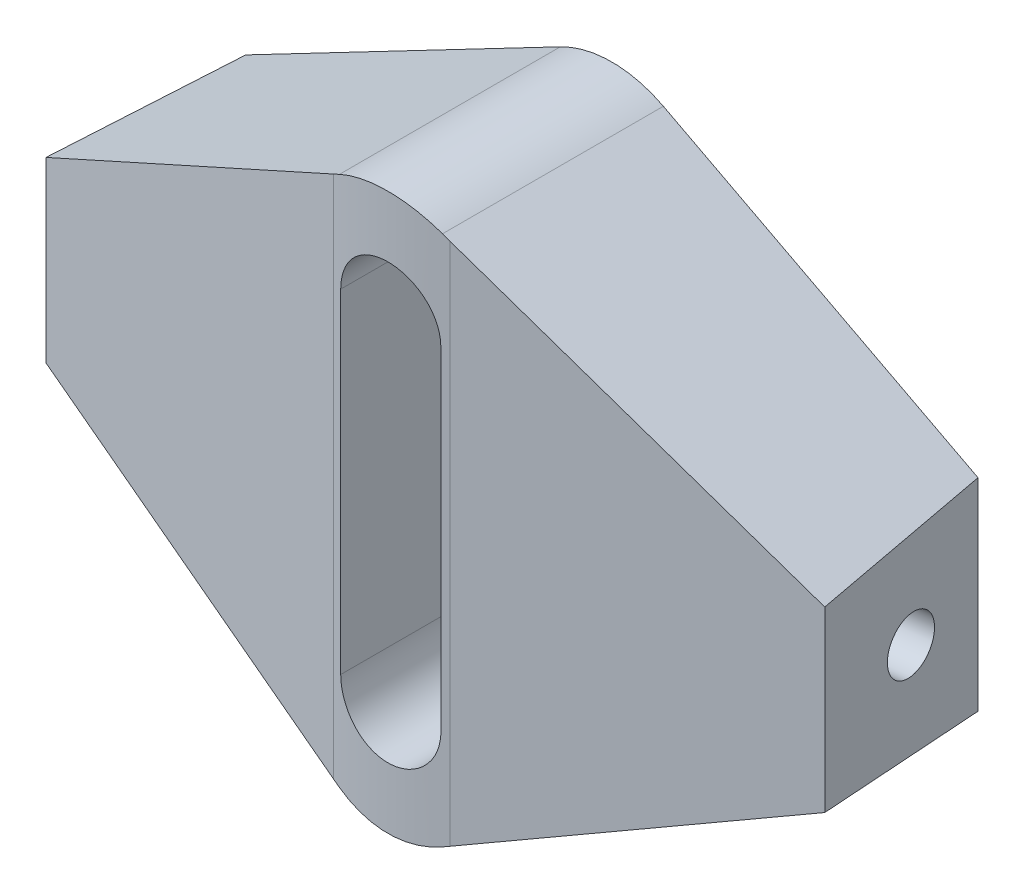
ISO-10303-21;
HEADER;
FILE_DESCRIPTION(('STEP AP214'),'2;1');
FILE_NAME('part.step','',(''),(''),'','','');
FILE_SCHEMA(('AUTOMOTIVE_DESIGN { 1 0 10303 214 1 1 1 1 }'));
ENDSEC;
DATA;
#1=APPLICATION_CONTEXT('core data for automotive mechanical design processes');
#2=APPLICATION_PROTOCOL_DEFINITION('international standard','automotive_design',2000,#1);
#3=PRODUCT_CONTEXT('',#1,'mechanical');
#4=PRODUCT('Part','Part','',(#3));
#5=PRODUCT_RELATED_PRODUCT_CATEGORY('part','',(#4));
#6=PRODUCT_DEFINITION_FORMATION('','',#4);
#7=PRODUCT_DEFINITION_CONTEXT('part definition',#1,'design');
#8=PRODUCT_DEFINITION('design','',#6,#7);
#9=PRODUCT_DEFINITION_SHAPE('','',#8);
#10=(LENGTH_UNIT() NAMED_UNIT(*) SI_UNIT(.MILLI.,.METRE.));
#11=(NAMED_UNIT(*) PLANE_ANGLE_UNIT() SI_UNIT($,.RADIAN.));
#12=(NAMED_UNIT(*) SI_UNIT($,.STERADIAN.) SOLID_ANGLE_UNIT());
#13=UNCERTAINTY_MEASURE_WITH_UNIT(LENGTH_MEASURE(1.E-05),#10,'distance_accuracy_value','');
#14=(GEOMETRIC_REPRESENTATION_CONTEXT(3) GLOBAL_UNCERTAINTY_ASSIGNED_CONTEXT((#13)) GLOBAL_UNIT_ASSIGNED_CONTEXT((#10,
#11,#12)) REPRESENTATION_CONTEXT('',''));
#15=CARTESIAN_POINT('',(0.,0.,0.));
#16=DIRECTION('',(0.,0.,1.));
#17=DIRECTION('',(1.,0.,0.));
#18=AXIS2_PLACEMENT_3D('',#15,#16,#17);
#19=CARTESIAN_POINT('',(16.4557904622396,-12.5,0.));
#20=DIRECTION('',(0.991444861373811,0.,-0.130526192220049));
#21=DIRECTION('',(-0.130526192220049,0.,-0.991444861373811));
#22=AXIS2_PLACEMENT_3D('',#19,#20,#21);
#23=PLANE('',#22);
#24=DIRECTION('',(0.,1.,0.));
#25=VECTOR('',#24,1.);
#26=CARTESIAN_POINT('',(16.4557904622396,0.,0.));
#27=LINE('',#26,#25);
#28=CARTESIAN_POINT('',(16.4557904622396,-4.54543643269465,0.));
#29=VERTEX_POINT('',#28);
#30=CARTESIAN_POINT('',(16.4557904622396,4.54543643269465,0.));
#31=VERTEX_POINT('',#30);
#32=EDGE_CURVE('E143',#29,#31,#27,.T.);
#33=ORIENTED_EDGE('',*,*,#32,.T.);
#34=DIRECTION('',(0.130223873455082,-0.0680216397384778,0.98914852237146));
#35=VECTOR('',#34,1.);
#36=CARTESIAN_POINT('',(18.7932076390999,3.32450093980472,17.754446134291));
#37=LINE('',#36,#35);
#38=CARTESIAN_POINT('',(17.5,4.,7.93155889099048));
#39=VERTEX_POINT('',#38);
#40=EDGE_CURVE('E155',#31,#39,#37,.T.);
#41=ORIENTED_EDGE('',*,*,#40,.T.);
#42=DIRECTION('',(0.,1.,0.));
#43=VECTOR('',#42,1.);
#44=CARTESIAN_POINT('',(17.5,-12.5,7.93155889099049));
#45=LINE('',#44,#43);
#46=CARTESIAN_POINT('',(17.5,-4.,7.93155889099049));
#47=VERTEX_POINT('',#46);
#48=EDGE_CURVE('E325',#47,#39,#45,.T.);
#49=ORIENTED_EDGE('',*,*,#48,.F.);
#50=DIRECTION('',(0.130223873455082,0.0680216397384778,0.98914852237146));
#51=VECTOR('',#50,1.);
#52=CARTESIAN_POINT('',(18.7932076390999,-3.32450093980472,17.754446134291));
#53=LINE('',#52,#51);
#54=EDGE_CURVE('E305',#29,#47,#53,.T.);
#55=ORIENTED_EDGE('',*,*,#54,.F.);
#56=EDGE_LOOP('',(#33,#41,#49,#55));
#57=FACE_BOUND('',#56,.T.);
#58=CARTESIAN_POINT('',(16.9126321350098,0.,3.47005701480834));
#59=DIRECTION('',(-0.991444861373811,0.,0.130526192220049));
#60=DIRECTION('',(0.130526192220049,0.,0.991444861373811));
#61=AXIS2_PLACEMENT_3D('',#58,#59,#60);
#62=CIRCLE('',#61,1.23);
#63=CARTESIAN_POINT('',(17.0731793514404,0.,4.68953419429812));
#64=VERTEX_POINT('',#63);
#65=EDGE_CURVE('E334',#64,#64,#62,.T.);
#66=ORIENTED_EDGE('',*,*,#65,.T.);
#67=EDGE_LOOP('',(#66));
#68=FACE_BOUND('',#67,.T.);
#69=ADVANCED_FACE('F35',(#57,#68),#23,.T.);
#70=CARTESIAN_POINT('',(-5.39275395509734,-10.3241455413745,20.));
#71=DIRECTION('',(0.462987271417713,0.886364928517133,0.));
#72=DIRECTION('',(-0.886364928517133,0.462987271417713,0.));
#73=AXIS2_PLACEMENT_3D('',#70,#71,#72);
#74=PLANE('',#73);
#75=CARTESIAN_POINT('',(0.,-13.1410174174703,-9.93710161283318));
#76=DIRECTION('',(0.462987271417713,0.886364928517133,0.));
#77=DIRECTION('',(-0.886364928517133,0.462987271417713,0.));
#78=AXIS2_PLACEMENT_3D('',#75,#76,#77);
#79=ELLIPSE('',#78,22.5640696698814,20.);
#80=CARTESIAN_POINT('',(-2.61052384440098,-11.7774263357337,9.89179561464304));
#81=VERTEX_POINT('',#80);
#82=CARTESIAN_POINT('',(-2.31493635708856,-11.9318246425857,9.92847337664623));
#83=VERTEX_POINT('',#82);
#84=EDGE_CURVE('E223',#81,#83,#79,.T.);
#85=ORIENTED_EDGE('',*,*,#84,.F.);
#86=DIRECTION('',(0.880391028023837,-0.45986684122003,0.115905677692871));
#87=VECTOR('',#86,1.);
#88=CARTESIAN_POINT('',(-4.32391251113367,-10.882448298848,9.66622371732975));
#89=LINE('',#88,#87);
#90=CARTESIAN_POINT('',(-17.5,-4.,7.93155889099049));
#91=VERTEX_POINT('',#90);
#92=EDGE_CURVE('E154',#91,#81,#89,.T.);
#93=ORIENTED_EDGE('',*,*,#92,.F.);
#94=DIRECTION('',(-0.130223873455082,0.0680216397384778,0.98914852237146));
#95=VECTOR('',#94,1.);
#96=CARTESIAN_POINT('',(-18.7932076390999,-3.32450093980472,17.754446134291));
#97=LINE('',#96,#95);
#98=CARTESIAN_POINT('',(-16.4557904622396,-4.54543643269465,0.));
#99=VERTEX_POINT('',#98);
#100=EDGE_CURVE('E137',#99,#91,#97,.T.);
#101=ORIENTED_EDGE('',*,*,#100,.F.);
#102=DIRECTION('',(0.886364928517133,-0.462987271417713,0.));
#103=VECTOR('',#102,1.);
#104=CARTESIAN_POINT('',(-5.39275395509734,-10.3241455413745,0.));
#105=LINE('',#104,#103);
#106=CARTESIAN_POINT('',(-2.31493635708856,-11.9318246425857,0.));
#107=VERTEX_POINT('',#106);
#108=EDGE_CURVE('E152',#99,#107,#105,.T.);
#109=ORIENTED_EDGE('',*,*,#108,.T.);
#110=DIRECTION('',(0.,0.,-1.));
#111=VECTOR('',#110,1.);
#112=CARTESIAN_POINT('',(-2.31493635708856,-11.9318246425857,20.));
#113=LINE('',#112,#111);
#114=EDGE_CURVE('E144',#83,#107,#113,.T.);
#115=ORIENTED_EDGE('',*,*,#114,.F.);
#116=EDGE_LOOP('',(#85,#93,#101,#109,#115));
#117=FACE_BOUND('',#116,.T.);
#118=ADVANCED_FACE('F150',(#117),#74,.F.);
#119=CARTESIAN_POINT('',(0.,-7.5,20.));
#120=DIRECTION('',(0.,0.,-1.));
#121=DIRECTION('',(-1.,0.,0.));
#122=AXIS2_PLACEMENT_3D('',#119,#120,#121);
#123=CYLINDRICAL_SURFACE('',#122,5.00000000000001);
#124=CARTESIAN_POINT('',(-2.31493635708856,-11.9318246425857,9.92847337664623));
#125=CARTESIAN_POINT('',(-2.19333215452756,-11.9953597274722,9.94265402384997));
#126=CARTESIAN_POINT('',(-2.06901882687834,-12.0539073956408,9.95599890274456));
#127=CARTESIAN_POINT('',(-1.81582074158714,-12.1606474780974,9.9807011710002));
#128=CARTESIAN_POINT('',(-1.68693558904696,-12.2088389953076,9.99205838816876));
#129=CARTESIAN_POINT('',(-1.42564593541198,-12.2944149876899,10.0124524603913));
#130=CARTESIAN_POINT('',(-1.29324663995977,-12.3318145695915,10.0214925569874));
#131=CARTESIAN_POINT('',(-1.02568136931849,-12.3955989041025,10.0370298053806));
#132=CARTESIAN_POINT('',(-0.890515558272381,-12.4219843082295,10.0435271075892));
#133=CARTESIAN_POINT('',(-0.618154804375756,-12.4635563337013,10.0538084635399));
#134=CARTESIAN_POINT('',(-0.480957046415538,-12.4787255707246,10.0575883051469));
#135=CARTESIAN_POINT('',(-0.205728723633959,-12.4976697027807,10.062313818016));
#136=CARTESIAN_POINT('',(-0.0676981643947863,-12.5014446741033,10.0632595082541));
#137=CARTESIAN_POINT('',(0.208199184895595,-12.4975682503535,10.0622905086372));
#138=CARTESIAN_POINT('',(0.34606596529908,-12.4899162126016,10.0603756578993));
#139=CARTESIAN_POINT('',(0.620564245981846,-12.4632554447284,10.0537397362564));
#140=CARTESIAN_POINT('',(0.757196308248942,-12.44425217601,10.0490200148606));
#141=CARTESIAN_POINT('',(1.01670932679975,-12.3971601699899,10.0374248048927));
#142=CARTESIAN_POINT('',(1.13976734084774,-12.3699869628724,10.0307680896729));
#143=CARTESIAN_POINT('',(1.38335830082284,-12.3064709115943,10.0153723329345));
#144=CARTESIAN_POINT('',(1.50389132514566,-12.2701283525814,10.0066333561703));
#145=CARTESIAN_POINT('',(1.74182818661013,-12.1884817383082,9.98726225461061));
#146=CARTESIAN_POINT('',(1.85922953503998,-12.1431707833607,9.97662867286472));
#147=CARTESIAN_POINT('',(2.09015426569916,-12.0439053344489,9.95372019789083));
#148=CARTESIAN_POINT('',(2.2036776565948,-11.9899508598025,9.94144530833106));
#149=CARTESIAN_POINT('',(2.31493635708856,-11.9318246425857,9.92847337664623));
#150=B_SPLINE_CURVE_WITH_KNOTS('',3,(#124,#125,#126,#127,#128,#129,#130,#131,#132,#133,#134,
#135,#136,#137,#138,#139,#140,#141,#142,#143,#144,#145,#146,#147,#148,#149),.UNSPECIFIED.,.F.,
.F.,(4,2,2,2,2,2,2,2,2,2,2,2,4),(0.,0.41368767373807,0.827411167796499,1.24055268379281,
1.65366975792008,2.06742580179777,2.48117907538193,2.89495562021185,3.30853324544206,
3.68675655633238,4.0649681067137,4.44347176686607,4.82197458109683),.UNSPECIFIED.);
#151=CARTESIAN_POINT('',(2.31493635708856,-11.9318246425857,9.92847337664624));
#152=VERTEX_POINT('',#151);
#153=EDGE_CURVE('E286',#83,#152,#150,.T.);
#154=ORIENTED_EDGE('',*,*,#153,.F.);
#155=ORIENTED_EDGE('',*,*,#114,.T.);
#156=CARTESIAN_POINT('',(0.,-7.5,0.));
#157=DIRECTION('',(0.,0.,1.));
#158=DIRECTION('',(1.,0.,0.));
#159=AXIS2_PLACEMENT_3D('',#156,#157,#158);
#160=CIRCLE('',#159,5.00000000000001);
#161=CARTESIAN_POINT('',(2.31493635708856,-11.9318246425857,0.));
#162=VERTEX_POINT('',#161);
#163=EDGE_CURVE('E160',#107,#162,#160,.T.);
#164=ORIENTED_EDGE('',*,*,#163,.T.);
#165=DIRECTION('',(0.,0.,-1.));
#166=VECTOR('',#165,1.);
#167=CARTESIAN_POINT('',(2.31493635708856,-11.9318246425857,20.));
#168=LINE('',#167,#166);
#169=EDGE_CURVE('E185',#152,#162,#168,.T.);
#170=ORIENTED_EDGE('',*,*,#169,.F.);
#171=EDGE_LOOP('',(#154,#155,#164,#170));
#172=FACE_BOUND('',#171,.T.);
#173=ADVANCED_FACE('F279',(#172),#123,.T.);
#174=CARTESIAN_POINT('',(5.39275395509734,-10.3241455413745,20.));
#175=DIRECTION('',(0.462987271417713,-0.886364928517133,0.));
#176=DIRECTION('',(0.886364928517133,0.462987271417713,0.));
#177=AXIS2_PLACEMENT_3D('',#174,#175,#176);
#178=PLANE('',#177);
#179=DIRECTION('',(-0.886364928517133,-0.462987271417713,0.));
#180=VECTOR('',#179,1.);
#181=CARTESIAN_POINT('',(5.39275395509734,-10.3241455413745,0.));
#182=LINE('',#181,#180);
#183=EDGE_CURVE('E163',#29,#162,#182,.T.);
#184=ORIENTED_EDGE('',*,*,#183,.F.);
#185=ORIENTED_EDGE('',*,*,#54,.T.);
#186=DIRECTION('',(-0.880391028023837,-0.45986684122003,0.115905677692871));
#187=VECTOR('',#186,1.);
#188=CARTESIAN_POINT('',(4.32391251113367,-10.882448298848,9.66622371732975));
#189=LINE('',#188,#187);
#190=CARTESIAN_POINT('',(2.61052384440098,-11.7774263357337,9.89179561464304));
#191=VERTEX_POINT('',#190);
#192=EDGE_CURVE('E219',#47,#191,#189,.T.);
#193=ORIENTED_EDGE('',*,*,#192,.T.);
#194=CARTESIAN_POINT('',(0.,-13.1410174174703,-9.93710161283318));
#195=DIRECTION('',(0.462987271417713,-0.886364928517133,0.));
#196=DIRECTION('',(0.886364928517133,0.462987271417713,0.));
#197=AXIS2_PLACEMENT_3D('',#194,#195,#196);
#198=ELLIPSE('',#197,22.5640696698814,20.);
#199=EDGE_CURVE('E290',#191,#152,#198,.T.);
#200=ORIENTED_EDGE('',*,*,#199,.T.);
#201=ORIENTED_EDGE('',*,*,#169,.T.);
#202=EDGE_LOOP('',(#184,#185,#193,#200,#201));
#203=FACE_BOUND('',#202,.T.);
#204=ADVANCED_FACE('F275',(#203),#178,.T.);
#205=CARTESIAN_POINT('',(5.39275395509734,10.3241455413745,20.));
#206=DIRECTION('',(-0.462987271417713,-0.886364928517133,0.));
#207=DIRECTION('',(0.886364928517133,-0.462987271417713,0.));
#208=AXIS2_PLACEMENT_3D('',#205,#206,#207);
#209=PLANE('',#208);
#210=ORIENTED_EDGE('',*,*,#40,.F.);
#211=DIRECTION('',(-0.886364928517133,0.462987271417713,0.));
#212=VECTOR('',#211,1.);
#213=CARTESIAN_POINT('',(5.39275395509734,10.3241455413745,0.));
#214=LINE('',#213,#212);
#215=CARTESIAN_POINT('',(2.31493635708856,11.9318246425857,0.));
#216=VERTEX_POINT('',#215);
#217=EDGE_CURVE('E171',#31,#216,#214,.T.);
#218=ORIENTED_EDGE('',*,*,#217,.T.);
#219=DIRECTION('',(0.,0.,-1.));
#220=VECTOR('',#219,1.);
#221=CARTESIAN_POINT('',(2.31493635708856,11.9318246425857,20.));
#222=LINE('',#221,#220);
#223=CARTESIAN_POINT('',(2.31493635708856,11.9318246425857,9.92847337664623));
#224=VERTEX_POINT('',#223);
#225=EDGE_CURVE('E181',#224,#216,#222,.T.);
#226=ORIENTED_EDGE('',*,*,#225,.F.);
#227=CARTESIAN_POINT('',(0.,13.1410174174704,-9.93710161283318));
#228=DIRECTION('',(-0.462987271417713,-0.886364928517133,0.));
#229=DIRECTION('',(-0.886364928517133,0.462987271417713,0.));
#230=AXIS2_PLACEMENT_3D('',#227,#228,#229);
#231=ELLIPSE('',#230,22.5640696698814,20.);
#232=CARTESIAN_POINT('',(2.61052384440098,11.7774263357337,9.89179561464304));
#233=VERTEX_POINT('',#232);
#234=EDGE_CURVE('E262',#233,#224,#231,.T.);
#235=ORIENTED_EDGE('',*,*,#234,.F.);
#236=DIRECTION('',(-0.880391028023837,0.45986684122003,0.115905677692871));
#237=VECTOR('',#236,1.);
#238=CARTESIAN_POINT('',(4.32391251113367,10.882448298848,9.66622371732975));
#239=LINE('',#238,#237);
#240=EDGE_CURVE('E12',#39,#233,#239,.T.);
#241=ORIENTED_EDGE('',*,*,#240,.F.);
#242=EDGE_LOOP('',(#210,#218,#226,#235,#241));
#243=FACE_BOUND('',#242,.T.);
#244=ADVANCED_FACE('F270',(#243),#209,.F.);
#245=CARTESIAN_POINT('',(0.,7.5,20.));
#246=DIRECTION('',(0.,0.,-1.));
#247=DIRECTION('',(-1.,0.,0.));
#248=AXIS2_PLACEMENT_3D('',#245,#246,#247);
#249=CYLINDRICAL_SURFACE('',#248,5.);
#250=DIRECTION('',(0.,0.,-1.));
#251=VECTOR('',#250,1.);
#252=CARTESIAN_POINT('',(-2.31493635708856,11.9318246425857,20.));
#253=LINE('',#252,#251);
#254=CARTESIAN_POINT('',(-2.31493635708856,11.9318246425857,9.92847337664623));
#255=VERTEX_POINT('',#254);
#256=CARTESIAN_POINT('',(-2.31493635708856,11.9318246425857,0.));
#257=VERTEX_POINT('',#256);
#258=EDGE_CURVE('E179',#255,#257,#253,.T.);
#259=ORIENTED_EDGE('',*,*,#258,.F.);
#260=CARTESIAN_POINT('',(-2.31493635708856,11.9318246425857,9.92847337664623));
#261=CARTESIAN_POINT('',(-2.19333215452756,11.9953597274722,9.94265402384997));
#262=CARTESIAN_POINT('',(-2.06901882687834,12.0539073956407,9.95599890274456));
#263=CARTESIAN_POINT('',(-1.81582074158714,12.1606474780974,9.9807011710002));
#264=CARTESIAN_POINT('',(-1.68693558904696,12.2088389953076,9.99205838816876));
#265=CARTESIAN_POINT('',(-1.42564593541198,12.2944149876898,10.0124524603913));
#266=CARTESIAN_POINT('',(-1.29324663995978,12.3318145695915,10.0214925569874));
#267=CARTESIAN_POINT('',(-1.0256813693185,12.3955989041025,10.0370298053806));
#268=CARTESIAN_POINT('',(-0.890515558272384,12.4219843082295,10.0435271075892));
#269=CARTESIAN_POINT('',(-0.618154804375759,12.4635563337013,10.0538084635399));
#270=CARTESIAN_POINT('',(-0.480957046415541,12.4787255707246,10.0575883051469));
#271=CARTESIAN_POINT('',(-0.205728723633963,12.4976697027807,10.062313818016));
#272=CARTESIAN_POINT('',(-0.0676981643947905,12.5014446741033,10.0632595082541));
#273=CARTESIAN_POINT('',(0.208199184895591,12.4975682503535,10.0622905086372));
#274=CARTESIAN_POINT('',(0.346065965299075,12.4899162126016,10.0603756578993));
#275=CARTESIAN_POINT('',(0.620564245981842,12.4632554447284,10.0537397362564));
#276=CARTESIAN_POINT('',(0.757196308248937,12.44425217601,10.0490200148606));
#277=CARTESIAN_POINT('',(1.01670932679975,12.3971601699899,10.0374248048927));
#278=CARTESIAN_POINT('',(1.13976734084774,12.3699869628724,10.0307680896729));
#279=CARTESIAN_POINT('',(1.38335830082284,12.3064709115943,10.0153723329345));
#280=CARTESIAN_POINT('',(1.50389132514565,12.2701283525814,10.0066333561703));
#281=CARTESIAN_POINT('',(1.74182818661012,12.1884817383082,9.98726225461061));
#282=CARTESIAN_POINT('',(1.85922953503998,12.1431707833607,9.97662867286472));
#283=CARTESIAN_POINT('',(2.09015426569915,12.0439053344489,9.95372019789083));
#284=CARTESIAN_POINT('',(2.20367765659479,11.9899508598025,9.94144530833106));
#285=CARTESIAN_POINT('',(2.31493635708856,11.9318246425857,9.92847337664623));
#286=B_SPLINE_CURVE_WITH_KNOTS('',3,(#260,#261,#262,#263,#264,#265,#266,#267,#268,#269,#270,
#271,#272,#273,#274,#275,#276,#277,#278,#279,#280,#281,#282,#283,#284,#285),.UNSPECIFIED.,.F.,
.F.,(4,2,2,2,2,2,2,2,2,2,2,2,4),(0.,0.41368767373807,0.827411167796498,1.24055268379281,
1.65366975792008,2.06742580179777,2.48117907538193,2.89495562021185,3.30853324544206,
3.68675655633238,4.0649681067137,4.44347176686607,4.82197458109683),.UNSPECIFIED.);
#287=EDGE_CURVE('E256',#255,#224,#286,.T.);
#288=ORIENTED_EDGE('',*,*,#287,.T.);
#289=ORIENTED_EDGE('',*,*,#225,.T.);
#290=CARTESIAN_POINT('',(0.,7.5,0.));
#291=DIRECTION('',(0.,0.,1.));
#292=DIRECTION('',(1.,0.,0.));
#293=AXIS2_PLACEMENT_3D('',#290,#291,#292);
#294=CIRCLE('',#293,5.);
#295=EDGE_CURVE('E174',#257,#216,#294,.F.);
#296=ORIENTED_EDGE('',*,*,#295,.F.);
#297=EDGE_LOOP('',(#259,#288,#289,#296));
#298=FACE_BOUND('',#297,.T.);
#299=ADVANCED_FACE('F264',(#298),#249,.T.);
#300=CARTESIAN_POINT('',(-5.39275395509734,10.3241455413745,20.));
#301=DIRECTION('',(-0.462987271417713,0.886364928517133,0.));
#302=DIRECTION('',(-0.886364928517133,-0.462987271417713,0.));
#303=AXIS2_PLACEMENT_3D('',#300,#301,#302);
#304=PLANE('',#303);
#305=DIRECTION('',(0.880391028023837,0.45986684122003,0.115905677692871));
#306=VECTOR('',#305,1.);
#307=CARTESIAN_POINT('',(-4.32391251113367,10.882448298848,9.66622371732975));
#308=LINE('',#307,#306);
#309=CARTESIAN_POINT('',(-17.5,4.,7.93155889099049));
#310=VERTEX_POINT('',#309);
#311=CARTESIAN_POINT('',(-2.61052384440098,11.7774263357337,9.89179561464304));
#312=VERTEX_POINT('',#311);
#313=EDGE_CURVE('E310',#310,#312,#308,.T.);
#314=ORIENTED_EDGE('',*,*,#313,.T.);
#315=CARTESIAN_POINT('',(0.,13.1410174174704,-9.93710161283318));
#316=DIRECTION('',(-0.462987271417713,0.886364928517133,0.));
#317=DIRECTION('',(0.886364928517133,0.462987271417713,0.));
#318=AXIS2_PLACEMENT_3D('',#315,#316,#317);
#319=ELLIPSE('',#318,22.5640696698814,20.);
#320=EDGE_CURVE('E206',#312,#255,#319,.T.);
#321=ORIENTED_EDGE('',*,*,#320,.T.);
#322=ORIENTED_EDGE('',*,*,#258,.T.);
#323=DIRECTION('',(0.886364928517133,0.462987271417713,0.));
#324=VECTOR('',#323,1.);
#325=CARTESIAN_POINT('',(-5.39275395509734,10.3241455413745,0.));
#326=LINE('',#325,#324);
#327=CARTESIAN_POINT('',(-16.4557904622396,4.54543643269465,0.));
#328=VERTEX_POINT('',#327);
#329=EDGE_CURVE('E176',#328,#257,#326,.T.);
#330=ORIENTED_EDGE('',*,*,#329,.F.);
#331=DIRECTION('',(-0.130223873455082,-0.0680216397384778,0.98914852237146));
#332=VECTOR('',#331,1.);
#333=CARTESIAN_POINT('',(-18.7932076390999,3.32450093980472,17.754446134291));
#334=LINE('',#333,#332);
#335=EDGE_CURVE('E59',#328,#310,#334,.T.);
#336=ORIENTED_EDGE('',*,*,#335,.T.);
#337=EDGE_LOOP('',(#314,#321,#322,#330,#336));
#338=FACE_BOUND('',#337,.T.);
#339=ADVANCED_FACE('F269',(#338),#304,.T.);
#340=CARTESIAN_POINT('',(0.,7.5,20.));
#341=DIRECTION('',(0.,0.,-1.));
#342=DIRECTION('',(-1.,0.,0.));
#343=AXIS2_PLACEMENT_3D('',#340,#341,#342);
#344=CYLINDRICAL_SURFACE('',#343,2.25);
#345=DIRECTION('',(0.,0.,-1.));
#346=VECTOR('',#345,1.);
#347=CARTESIAN_POINT('',(2.25,7.5,20.));
#348=LINE('',#347,#346);
#349=CARTESIAN_POINT('',(2.25,7.5,9.93593288117403));
#350=VERTEX_POINT('',#349);
#351=CARTESIAN_POINT('',(2.25,7.5,0.));
#352=VERTEX_POINT('',#351);
#353=EDGE_CURVE('E182',#350,#352,#348,.T.);
#354=ORIENTED_EDGE('',*,*,#353,.F.);
#355=CARTESIAN_POINT('',(2.25,7.5,9.93593288117402));
#356=CARTESIAN_POINT('',(2.24999981834973,7.56308850480176,9.93593115836939));
#357=CARTESIAN_POINT('',(2.2473448903185,7.62614658881609,9.93623368318766));
#358=CARTESIAN_POINT('',(2.23675486634087,7.75180760388427,9.93742906380166));
#359=CARTESIAN_POINT('',(2.22882014754874,7.81441056712614,9.93832187743091));
#360=CARTESIAN_POINT('',(2.19717887631467,8.00072834134734,9.94185420384217));
#361=CARTESIAN_POINT('',(2.16563495617706,8.12318886833283,9.9453477342335));
#362=CARTESIAN_POINT('',(2.08255229295352,8.36102981992826,9.95422061234297));
#363=CARTESIAN_POINT('',(2.03100648638886,8.47640772668796,9.95960062619032));
#364=CARTESIAN_POINT('',(1.90940115019305,8.69688186732826,9.97163783216902));
#365=CARTESIAN_POINT('',(1.8393434796092,8.8019791321873,9.97829489603469));
#366=CARTESIAN_POINT('',(1.68237119375748,8.99936448027742,9.99216934719148));
#367=CARTESIAN_POINT('',(1.595390740805,9.09160003806875,9.99938885466125));
#368=CARTESIAN_POINT('',(1.40717183353723,9.26020812876334,10.0135564512752));
#369=CARTESIAN_POINT('',(1.30593121133241,9.33657824536003,10.0205044989454));
#370=CARTESIAN_POINT('',(1.09174158430743,9.47146131242061,10.0333671745293));
#371=CARTESIAN_POINT('',(0.978762329645395,9.52992651363291,10.0392790214492));
#372=CARTESIAN_POINT('',(0.744518780663256,9.62703177520918,10.0493792898468));
#373=CARTESIAN_POINT('',(0.623255233735557,9.66567362132742,10.0535678665556));
#374=CARTESIAN_POINT('',(0.376423789207964,9.72188175033955,10.0597349839278));
#375=CARTESIAN_POINT('',(0.250876286478718,9.7395365603871,10.0617228053229));
#376=CARTESIAN_POINT('',(-0.00141740258608315,9.75354370433772,10.0632960897645));
#377=CARTESIAN_POINT('',(-0.128163579383982,9.74989620759769,10.06288157191));
#378=CARTESIAN_POINT('',(-0.378648308137059,9.72147293721911,10.0597043482785));
#379=CARTESIAN_POINT('',(-0.502397885230162,9.69679296708725,10.056952290251));
#380=CARTESIAN_POINT('',(-0.743986756542818,9.62715491936661,10.0494213349309));
#381=CARTESIAN_POINT('',(-0.861825987611552,9.58219662515941,10.0446424159868));
#382=CARTESIAN_POINT('',(-1.08855142753239,9.47317364394307,10.033576413428));
#383=CARTESIAN_POINT('',(-1.19741711368342,9.40906663018156,10.0272859948483));
#384=CARTESIAN_POINT('',(-1.402875909285,9.26359945792087,10.0139022495118));
#385=CARTESIAN_POINT('',(-1.49946909632613,9.18223940850948,10.0068089278318));
#386=CARTESIAN_POINT('',(-1.67819583731279,9.00405091751496,9.99256864880766));
#387=CARTESIAN_POINT('',(-1.7602483457537,8.90714118090841,9.9854216088904));
#388=CARTESIAN_POINT('',(-1.90695929778882,8.70084426723949,9.97191528268373));
#389=CARTESIAN_POINT('',(-1.97161250949913,8.59145335119585,9.96555623364879));
#390=CARTESIAN_POINT('',(-2.08168995749661,8.36321775780625,9.95434486703169));
#391=CARTESIAN_POINT('',(-2.12709698005098,8.24436472993616,9.94949389930191));
#392=CARTESIAN_POINT('',(-2.19721914736141,8.00074175311645,9.94186951205046));
#393=CARTESIAN_POINT('',(-2.22196552372431,7.8759810373195,9.93909295741867));
#394=CARTESIAN_POINT('',(-2.24070092433873,7.70861284017103,9.9369837218777));
#395=CARTESIAN_POINT('',(-2.24418977322343,7.66693058122592,9.9365899203525));
#396=CARTESIAN_POINT('',(-2.24883617633498,7.58350471810454,9.93606481572253));
#397=CARTESIAN_POINT('',(-2.24999762925207,7.54176133393488,9.93593307363692));
#398=CARTESIAN_POINT('',(-2.25,7.5,9.93593288117403));
#399=B_SPLINE_CURVE_WITH_KNOTS('',3,(#355,#356,#357,#358,#359,#360,#361,#362,#363,#364,#365,
#366,#367,#368,#369,#370,#371,#372,#373,#374,#375,#376,#377,#378,#379,#380,#381,#382,#383,#384,
#385,#386,#387,#388,#389,#390,#391,#392,#393,#394,#395,#396,#397,#398),.UNSPECIFIED.,.F.,.F.,(4,
2,2,2,2,2,2,2,2,2,2,2,2,2,2,2,2,2,2,2,2,4),(0.,0.189148634216167,0.37828375832152,
0.755852600124273,1.13355489834568,1.51121928035549,1.89038344838192,2.26960532084141,
2.64982987713446,3.03002017550802,3.40860100575688,3.78717882622908,4.16404137498131,
4.5409079495741,4.91861380179391,5.29631726591987,5.67606390579928,6.0559246063822,
6.43612433995169,6.81574829971238,6.94119038484395,7.0664221619569),.UNSPECIFIED.);
#400=CARTESIAN_POINT('',(-2.25,7.5,9.93593288117403));
#401=VERTEX_POINT('',#400);
#402=EDGE_CURVE('E198',#350,#401,#399,.T.);
#403=ORIENTED_EDGE('',*,*,#402,.T.);
#404=DIRECTION('',(0.,0.,-1.));
#405=VECTOR('',#404,1.);
#406=CARTESIAN_POINT('',(-2.25,7.5,20.));
#407=LINE('',#406,#405);
#408=CARTESIAN_POINT('',(-2.25,7.5,0.));
#409=VERTEX_POINT('',#408);
#410=EDGE_CURVE('E178',#401,#409,#407,.T.);
#411=ORIENTED_EDGE('',*,*,#410,.T.);
#412=CARTESIAN_POINT('',(0.,7.5,0.));
#413=DIRECTION('',(0.,0.,1.));
#414=DIRECTION('',(1.,0.,0.));
#415=AXIS2_PLACEMENT_3D('',#412,#413,#414);
#416=CIRCLE('',#415,2.25);
#417=EDGE_CURVE('E216',#352,#409,#416,.T.);
#418=ORIENTED_EDGE('',*,*,#417,.F.);
#419=EDGE_LOOP('',(#354,#403,#411,#418));
#420=FACE_BOUND('',#419,.T.);
#421=ADVANCED_FACE('F37',(#420),#344,.F.);
#422=CARTESIAN_POINT('',(2.25,0.,20.));
#423=DIRECTION('',(-1.,0.,0.));
#424=DIRECTION('',(0.,0.,1.));
#425=AXIS2_PLACEMENT_3D('',#422,#423,#424);
#426=PLANE('',#425);
#427=DIRECTION('',(0.,0.,-1.));
#428=VECTOR('',#427,1.);
#429=CARTESIAN_POINT('',(2.25,-7.5,20.));
#430=LINE('',#429,#428);
#431=CARTESIAN_POINT('',(2.25,-7.5,9.93593288117402));
#432=VERTEX_POINT('',#431);
#433=CARTESIAN_POINT('',(2.25,-7.5,0.));
#434=VERTEX_POINT('',#433);
#435=EDGE_CURVE('E192',#432,#434,#430,.T.);
#436=ORIENTED_EDGE('',*,*,#435,.F.);
#437=DIRECTION('',(0.,1.,0.));
#438=VECTOR('',#437,1.);
#439=CARTESIAN_POINT('',(2.25,-12.5,9.93593288117403));
#440=LINE('',#439,#438);
#441=EDGE_CURVE('E207',#432,#350,#440,.T.);
#442=ORIENTED_EDGE('',*,*,#441,.T.);
#443=ORIENTED_EDGE('',*,*,#353,.T.);
#444=DIRECTION('',(0.,1.,0.));
#445=VECTOR('',#444,1.);
#446=CARTESIAN_POINT('',(2.25,0.,0.));
#447=LINE('',#446,#445);
#448=EDGE_CURVE('E218',#434,#352,#447,.T.);
#449=ORIENTED_EDGE('',*,*,#448,.F.);
#450=EDGE_LOOP('',(#436,#442,#443,#449));
#451=FACE_BOUND('',#450,.T.);
#452=ADVANCED_FACE('F230',(#451),#426,.T.);
#453=CARTESIAN_POINT('',(0.,-7.5,20.));
#454=DIRECTION('',(0.,0.,-1.));
#455=DIRECTION('',(-1.,0.,0.));
#456=AXIS2_PLACEMENT_3D('',#453,#454,#455);
#457=CYLINDRICAL_SURFACE('',#456,2.25);
#458=DIRECTION('',(0.,0.,-1.));
#459=VECTOR('',#458,1.);
#460=CARTESIAN_POINT('',(-2.25,-7.5,20.));
#461=LINE('',#460,#459);
#462=CARTESIAN_POINT('',(-2.25,-7.5,9.93593288117403));
#463=VERTEX_POINT('',#462);
#464=CARTESIAN_POINT('',(-2.25,-7.5,0.));
#465=VERTEX_POINT('',#464);
#466=EDGE_CURVE('E190',#463,#465,#461,.T.);
#467=ORIENTED_EDGE('',*,*,#466,.F.);
#468=CARTESIAN_POINT('',(-2.25,-7.5,9.93593288117402));
#469=CARTESIAN_POINT('',(-2.24999981834973,-7.56308850480176,9.93593115836939));
#470=CARTESIAN_POINT('',(-2.2473448903185,-7.62614658881608,9.93623368318766));
#471=CARTESIAN_POINT('',(-2.23675486634087,-7.75180760388427,9.93742906380166));
#472=CARTESIAN_POINT('',(-2.22882014754874,-7.81441056712614,9.93832187743091));
#473=CARTESIAN_POINT('',(-2.19717887631467,-8.00072834134734,9.94185420384217));
#474=CARTESIAN_POINT('',(-2.16563495617706,-8.12318886833283,9.9453477342335));
#475=CARTESIAN_POINT('',(-2.08255229295351,-8.36102981992826,9.95422061234297));
#476=CARTESIAN_POINT('',(-2.03100648638886,-8.47640772668796,9.95960062619032));
#477=CARTESIAN_POINT('',(-1.90940115019305,-8.69688186732826,9.97163783216902));
#478=CARTESIAN_POINT('',(-1.8393434796092,-8.8019791321873,9.97829489603469));
#479=CARTESIAN_POINT('',(-1.68237119375747,-8.99936448027742,9.99216934719149));
#480=CARTESIAN_POINT('',(-1.59539074080499,-9.09160003806875,9.99938885466126));
#481=CARTESIAN_POINT('',(-1.40717183353722,-9.26020812876334,10.0135564512752));
#482=CARTESIAN_POINT('',(-1.30593121133241,-9.33657824536003,10.0205044989454));
#483=CARTESIAN_POINT('',(-1.09174158430742,-9.47146131242061,10.0333671745293));
#484=CARTESIAN_POINT('',(-0.978762329645387,-9.52992651363291,10.0392790214492));
#485=CARTESIAN_POINT('',(-0.744518780663249,-9.62703177520918,10.0493792898468));
#486=CARTESIAN_POINT('',(-0.623255233735549,-9.66567362132742,10.0535678665556));
#487=CARTESIAN_POINT('',(-0.376423789207956,-9.72188175033955,10.0597349839278));
#488=CARTESIAN_POINT('',(-0.250876286478711,-9.7395365603871,10.0617228053229));
#489=CARTESIAN_POINT('',(0.00141740258609031,-9.75354370433772,10.0632960897644));
#490=CARTESIAN_POINT('',(0.128163579383989,-9.74989620759769,10.06288157191));
#491=CARTESIAN_POINT('',(0.378648308137067,-9.7214729372191,10.0597043482785));
#492=CARTESIAN_POINT('',(0.502397885230169,-9.69679296708725,10.056952290251));
#493=CARTESIAN_POINT('',(0.743986756542824,-9.6271549193666,10.0494213349309));
#494=CARTESIAN_POINT('',(0.861825987611558,-9.5821966251594,10.0446424159868));
#495=CARTESIAN_POINT('',(1.08855142753239,-9.47317364394307,10.033576413428));
#496=CARTESIAN_POINT('',(1.19741711368343,-9.40906663018156,10.0272859948483));
#497=CARTESIAN_POINT('',(1.402875909285,-9.26359945792086,10.0139022495118));
#498=CARTESIAN_POINT('',(1.49946909632613,-9.18223940850947,10.0068089278318));
#499=CARTESIAN_POINT('',(1.67819583731279,-9.00405091751496,9.99256864880766));
#500=CARTESIAN_POINT('',(1.7602483457537,-8.90714118090841,9.9854216088904));
#501=CARTESIAN_POINT('',(1.90695929778882,-8.70084426723949,9.97191528268374));
#502=CARTESIAN_POINT('',(1.97161250949913,-8.59145335119584,9.96555623364879));
#503=CARTESIAN_POINT('',(2.08168995749662,-8.36321775780624,9.95434486703169));
#504=CARTESIAN_POINT('',(2.12709698005098,-8.24436472993615,9.94949389930191));
#505=CARTESIAN_POINT('',(2.19721914736141,-8.00074175311644,9.94186951205047));
#506=CARTESIAN_POINT('',(2.22196552372431,-7.87598103731949,9.93909295741867));
#507=CARTESIAN_POINT('',(2.24070092433873,-7.70861284017102,9.9369837218777));
#508=CARTESIAN_POINT('',(2.24418977322343,-7.66693058122592,9.9365899203525));
#509=CARTESIAN_POINT('',(2.24883617633499,-7.58350471810454,9.93606481572253));
#510=CARTESIAN_POINT('',(2.24999762925207,-7.54176133393488,9.93593307363692));
#511=CARTESIAN_POINT('',(2.25,-7.5,9.93593288117403));
#512=B_SPLINE_CURVE_WITH_KNOTS('',3,(#468,#469,#470,#471,#472,#473,#474,#475,#476,#477,#478,
#479,#480,#481,#482,#483,#484,#485,#486,#487,#488,#489,#490,#491,#492,#493,#494,#495,#496,#497,
#498,#499,#500,#501,#502,#503,#504,#505,#506,#507,#508,#509,#510,#511),.UNSPECIFIED.,.F.,.F.,(4,
2,2,2,2,2,2,2,2,2,2,2,2,2,2,2,2,2,2,2,2,4),(0.,0.189148634216167,0.378283758321521,
0.755852600124274,1.13355489834568,1.5112192803555,1.89038344838192,2.26960532084141,
2.64982987713446,3.03002017550802,3.40860100575688,3.78717882622908,4.16404137498132,
4.5409079495741,4.91861380179391,5.29631726591987,5.67606390579928,6.0559246063822,
6.43612433995169,6.81574829971238,6.94119038484395,7.0664221619569),.UNSPECIFIED.);
#513=EDGE_CURVE('E51',#463,#432,#512,.T.);
#514=ORIENTED_EDGE('',*,*,#513,.T.);
#515=ORIENTED_EDGE('',*,*,#435,.T.);
#516=CARTESIAN_POINT('',(0.,-7.5,0.));
#517=DIRECTION('',(0.,0.,1.));
#518=DIRECTION('',(1.,0.,0.));
#519=AXIS2_PLACEMENT_3D('',#516,#517,#518);
#520=CIRCLE('',#519,2.25);
#521=EDGE_CURVE('E166',#465,#434,#520,.T.);
#522=ORIENTED_EDGE('',*,*,#521,.F.);
#523=EDGE_LOOP('',(#467,#514,#515,#522));
#524=FACE_BOUND('',#523,.T.);
#525=ADVANCED_FACE('F227',(#524),#457,.F.);
#526=CARTESIAN_POINT('',(-2.25,0.,20.));
#527=DIRECTION('',(-1.,0.,0.));
#528=DIRECTION('',(0.,0.,1.));
#529=AXIS2_PLACEMENT_3D('',#526,#527,#528);
#530=PLANE('',#529);
#531=DIRECTION('',(0.,1.,0.));
#532=VECTOR('',#531,1.);
#533=CARTESIAN_POINT('',(-2.25,-12.5,9.93593288117403));
#534=LINE('',#533,#532);
#535=EDGE_CURVE('E44',#463,#401,#534,.T.);
#536=ORIENTED_EDGE('',*,*,#535,.F.);
#537=ORIENTED_EDGE('',*,*,#466,.T.);
#538=DIRECTION('',(0.,1.,0.));
#539=VECTOR('',#538,1.);
#540=CARTESIAN_POINT('',(-2.25,0.,0.));
#541=LINE('',#540,#539);
#542=EDGE_CURVE('E161',#465,#409,#541,.T.);
#543=ORIENTED_EDGE('',*,*,#542,.T.);
#544=ORIENTED_EDGE('',*,*,#410,.F.);
#545=EDGE_LOOP('',(#536,#537,#543,#544));
#546=FACE_BOUND('',#545,.T.);
#547=ADVANCED_FACE('F209',(#546),#530,.F.);
#548=CARTESIAN_POINT('',(0.,0.,0.));
#549=DIRECTION('',(0.,0.,1.));
#550=DIRECTION('',(1.,0.,0.));
#551=AXIS2_PLACEMENT_3D('',#548,#549,#550);
#552=PLANE('',#551);
#553=ORIENTED_EDGE('',*,*,#417,.T.);
#554=ORIENTED_EDGE('',*,*,#542,.F.);
#555=ORIENTED_EDGE('',*,*,#521,.T.);
#556=ORIENTED_EDGE('',*,*,#448,.T.);
#557=EDGE_LOOP('',(#553,#554,#555,#556));
#558=FACE_BOUND('',#557,.T.);
#559=ORIENTED_EDGE('',*,*,#32,.F.);
#560=ORIENTED_EDGE('',*,*,#183,.T.);
#561=ORIENTED_EDGE('',*,*,#163,.F.);
#562=ORIENTED_EDGE('',*,*,#108,.F.);
#563=DIRECTION('',(0.,-1.,0.));
#564=VECTOR('',#563,1.);
#565=CARTESIAN_POINT('',(-16.4557904622396,0.,0.));
#566=LINE('',#565,#564);
#567=EDGE_CURVE('E134',#328,#99,#566,.T.);
#568=ORIENTED_EDGE('',*,*,#567,.F.);
#569=ORIENTED_EDGE('',*,*,#329,.T.);
#570=ORIENTED_EDGE('',*,*,#295,.T.);
#571=ORIENTED_EDGE('',*,*,#217,.F.);
#572=EDGE_LOOP('',(#559,#560,#561,#562,#568,#569,#570,#571));
#573=FACE_BOUND('',#572,.T.);
#574=ADVANCED_FACE('F158',(#558,#573),#552,.F.);
#575=CARTESIAN_POINT('',(17.5,-12.5,7.93155889099049));
#576=DIRECTION('',(0.130526192220049,0.,0.991444861373811));
#577=DIRECTION('',(0.991444861373811,0.,-0.130526192220049));
#578=AXIS2_PLACEMENT_3D('',#575,#576,#577);
#579=PLANE('',#578);
#580=ORIENTED_EDGE('',*,*,#48,.T.);
#581=ORIENTED_EDGE('',*,*,#240,.T.);
#582=DIRECTION('',(0.,1.,0.));
#583=VECTOR('',#582,1.);
#584=CARTESIAN_POINT('',(2.61052384440098,-12.5,9.89179561464304));
#585=LINE('',#584,#583);
#586=EDGE_CURVE('E319',#191,#233,#585,.T.);
#587=ORIENTED_EDGE('',*,*,#586,.F.);
#588=ORIENTED_EDGE('',*,*,#192,.F.);
#589=EDGE_LOOP('',(#580,#581,#587,#588));
#590=FACE_BOUND('',#589,.T.);
#591=ADVANCED_FACE('F249',(#590),#579,.T.);
#592=CARTESIAN_POINT('',(0.,-12.5,-9.93710161283318));
#593=DIRECTION('',(0.,1.,0.));
#594=DIRECTION('',(0.,0.,1.));
#595=AXIS2_PLACEMENT_3D('',#592,#593,#594);
#596=CYLINDRICAL_SURFACE('',#595,20.);
#597=ORIENTED_EDGE('',*,*,#441,.F.);
#598=ORIENTED_EDGE('',*,*,#513,.F.);
#599=ORIENTED_EDGE('',*,*,#535,.T.);
#600=ORIENTED_EDGE('',*,*,#402,.F.);
#601=EDGE_LOOP('',(#597,#598,#599,#600));
#602=FACE_BOUND('',#601,.T.);
#603=ORIENTED_EDGE('',*,*,#84,.T.);
#604=ORIENTED_EDGE('',*,*,#153,.T.);
#605=ORIENTED_EDGE('',*,*,#199,.F.);
#606=ORIENTED_EDGE('',*,*,#586,.T.);
#607=ORIENTED_EDGE('',*,*,#234,.T.);
#608=ORIENTED_EDGE('',*,*,#287,.F.);
#609=ORIENTED_EDGE('',*,*,#320,.F.);
#610=DIRECTION('',(0.,1.,0.));
#611=VECTOR('',#610,1.);
#612=CARTESIAN_POINT('',(-2.61052384440098,-12.5,9.89179561464304));
#613=LINE('',#612,#611);
#614=EDGE_CURVE('E295',#81,#312,#613,.T.);
#615=ORIENTED_EDGE('',*,*,#614,.F.);
#616=EDGE_LOOP('',(#603,#604,#605,#606,#607,#608,#609,#615));
#617=FACE_BOUND('',#616,.T.);
#618=ADVANCED_FACE('F196',(#602,#617),#596,.T.);
#619=CARTESIAN_POINT('',(-17.5,-12.5,7.93155889099049));
#620=DIRECTION('',(-0.130526192220049,0.,0.991444861373811));
#621=DIRECTION('',(0.991444861373811,0.,0.130526192220049));
#622=AXIS2_PLACEMENT_3D('',#619,#620,#621);
#623=PLANE('',#622);
#624=ORIENTED_EDGE('',*,*,#92,.T.);
#625=ORIENTED_EDGE('',*,*,#614,.T.);
#626=ORIENTED_EDGE('',*,*,#313,.F.);
#627=DIRECTION('',(0.,1.,0.));
#628=VECTOR('',#627,1.);
#629=CARTESIAN_POINT('',(-17.5,-12.5,7.93155889099049));
#630=LINE('',#629,#628);
#631=EDGE_CURVE('E316',#91,#310,#630,.T.);
#632=ORIENTED_EDGE('',*,*,#631,.F.);
#633=EDGE_LOOP('',(#624,#625,#626,#632));
#634=FACE_BOUND('',#633,.T.);
#635=ADVANCED_FACE('F248',(#634),#623,.T.);
#636=CARTESIAN_POINT('',(-16.4557904622396,-12.5,0.));
#637=DIRECTION('',(-0.991444861373811,0.,-0.130526192220049));
#638=DIRECTION('',(-0.130526192220049,0.,0.991444861373811));
#639=AXIS2_PLACEMENT_3D('',#636,#637,#638);
#640=PLANE('',#639);
#641=CARTESIAN_POINT('',(-16.9126321350098,0.,3.47005701480834));
#642=DIRECTION('',(-0.991444861373811,0.,-0.130526192220049));
#643=DIRECTION('',(-0.130526192220049,0.,0.991444861373811));
#644=AXIS2_PLACEMENT_3D('',#641,#642,#643);
#645=CIRCLE('',#644,1.23);
#646=CARTESIAN_POINT('',(-17.0731793514404,0.,4.68953419429812));
#647=VERTEX_POINT('',#646);
#648=EDGE_CURVE('E322',#647,#647,#645,.T.);
#649=ORIENTED_EDGE('',*,*,#648,.F.);
#650=EDGE_LOOP('',(#649));
#651=FACE_BOUND('',#650,.T.);
#652=ORIENTED_EDGE('',*,*,#100,.T.);
#653=ORIENTED_EDGE('',*,*,#631,.T.);
#654=ORIENTED_EDGE('',*,*,#335,.F.);
#655=ORIENTED_EDGE('',*,*,#567,.T.);
#656=EDGE_LOOP('',(#652,#653,#654,#655));
#657=FACE_BOUND('',#656,.T.);
#658=ADVANCED_FACE('F136',(#651,#657),#640,.T.);
#659=CARTESIAN_POINT('',(-5.01529379852405,0.,5.03637132144893));
#660=DIRECTION('',(-0.991444861373811,0.,-0.130526192220049));
#661=DIRECTION('',(-0.130526192220049,0.,0.991444861373811));
#662=AXIS2_PLACEMENT_3D('',#659,#660,#661);
#663=CYLINDRICAL_SURFACE('',#662,1.23);
#664=CARTESIAN_POINT('',(-5.01529379852405,0.,5.03637132144893));
#665=DIRECTION('',(-0.991444861373811,0.,-0.130526192220049));
#666=DIRECTION('',(-0.130526192220049,0.,0.991444861373811));
#667=AXIS2_PLACEMENT_3D('',#664,#665,#666);
#668=CIRCLE('',#667,1.23);
#669=CARTESIAN_POINT('',(-5.17584101495471,0.,6.25584850093871));
#670=VERTEX_POINT('',#669);
#671=EDGE_CURVE('E317',#670,#670,#668,.T.);
#672=ORIENTED_EDGE('',*,*,#671,.F.);
#673=EDGE_LOOP('',(#672));
#674=FACE_BOUND('',#673,.T.);
#675=ORIENTED_EDGE('',*,*,#648,.T.);
#676=EDGE_LOOP('',(#675));
#677=FACE_BOUND('',#676,.T.);
#678=ADVANCED_FACE('F356',(#674,#677),#663,.F.);
#679=CARTESIAN_POINT('',(-5.01529379852405,0.,5.03637132144893));
#680=DIRECTION('',(-0.991444861373811,0.,-0.130526192220049));
#681=DIRECTION('',(-0.130526192220049,0.,0.991444861373811));
#682=AXIS2_PLACEMENT_3D('',#679,#680,#681);
#683=PLANE('',#682);
#684=ORIENTED_EDGE('',*,*,#671,.T.);
#685=EDGE_LOOP('',(#684));
#686=FACE_BOUND('',#685,.T.);
#687=ADVANCED_FACE('F349',(#686),#683,.T.);
#688=CARTESIAN_POINT('',(5.01529379852405,0.,5.03637132144893));
#689=DIRECTION('',(0.991444861373811,0.,-0.130526192220049));
#690=DIRECTION('',(-0.130526192220049,0.,-0.991444861373811));
#691=AXIS2_PLACEMENT_3D('',#688,#689,#690);
#692=CYLINDRICAL_SURFACE('',#691,1.23);
#693=CARTESIAN_POINT('',(5.01529379852405,0.,5.03637132144893));
#694=DIRECTION('',(-0.991444861373811,0.,0.130526192220049));
#695=DIRECTION('',(0.130526192220049,0.,0.991444861373811));
#696=AXIS2_PLACEMENT_3D('',#693,#694,#695);
#697=CIRCLE('',#696,1.23);
#698=CARTESIAN_POINT('',(5.17584101495471,0.,6.25584850093871));
#699=VERTEX_POINT('',#698);
#700=EDGE_CURVE('E332',#699,#699,#697,.T.);
#701=ORIENTED_EDGE('',*,*,#700,.T.);
#702=EDGE_LOOP('',(#701));
#703=FACE_BOUND('',#702,.T.);
#704=ORIENTED_EDGE('',*,*,#65,.F.);
#705=EDGE_LOOP('',(#704));
#706=FACE_BOUND('',#705,.T.);
#707=ADVANCED_FACE('F340',(#703,#706),#692,.F.);
#708=CARTESIAN_POINT('',(5.01529379852405,0.,5.03637132144893));
#709=DIRECTION('',(0.991444861373811,0.,-0.130526192220049));
#710=DIRECTION('',(0.130526192220049,0.,0.991444861373811));
#711=AXIS2_PLACEMENT_3D('',#708,#709,#710);
#712=PLANE('',#711);
#713=ORIENTED_EDGE('',*,*,#700,.F.);
#714=EDGE_LOOP('',(#713));
#715=FACE_BOUND('',#714,.T.);
#716=ADVANCED_FACE('F343',(#715),#712,.T.);
#717=CLOSED_SHELL('',(#69,#118,#173,#204,#244,#299,#339,#421,#452,#525,#547,#574,#591,#618,#635,
#658,#678,#687,#707,#716));
#718=MANIFOLD_SOLID_BREP('B2',#717);
#719=ADVANCED_BREP_SHAPE_REPRESENTATION('',(#18,#718),#14);
#720=SHAPE_DEFINITION_REPRESENTATION(#9,#719);
ENDSEC;
END-ISO-10303-21;
